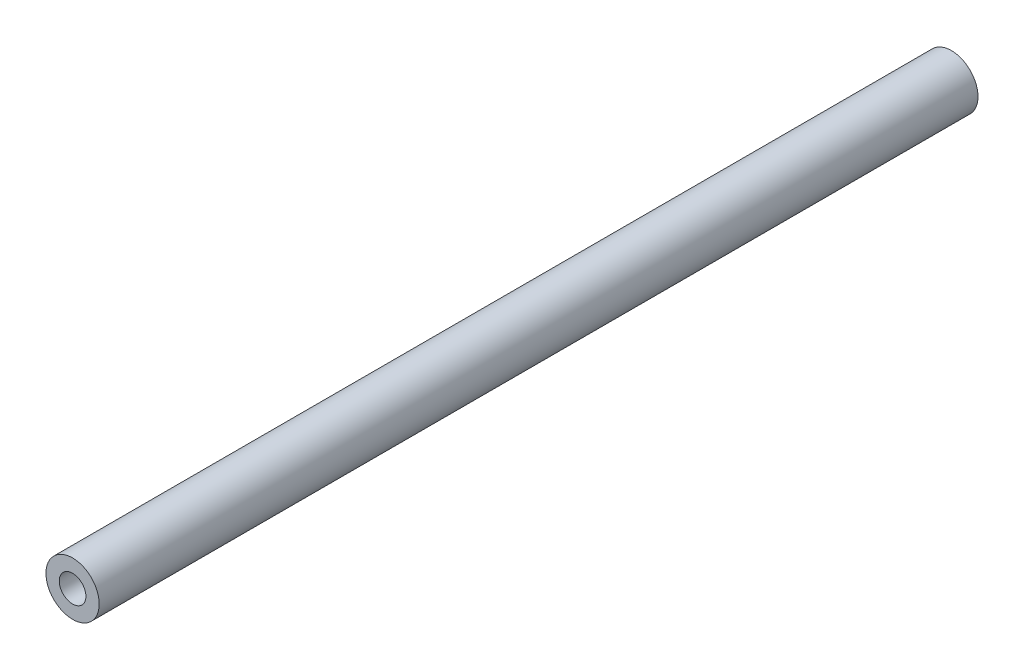
ISO-10303-21;
HEADER;
FILE_DESCRIPTION(('STEP AP214'),'2;1');
FILE_NAME('part.step','',(''),(''),'','','');
FILE_SCHEMA(('AUTOMOTIVE_DESIGN { 1 0 10303 214 1 1 1 1 }'));
ENDSEC;
DATA;
#1=APPLICATION_CONTEXT('core data for automotive mechanical design processes');
#2=APPLICATION_PROTOCOL_DEFINITION('international standard','automotive_design',2000,#1);
#3=PRODUCT_CONTEXT('',#1,'mechanical');
#4=PRODUCT('Part','Part','',(#3));
#5=PRODUCT_RELATED_PRODUCT_CATEGORY('part','',(#4));
#6=PRODUCT_DEFINITION_FORMATION('','',#4);
#7=PRODUCT_DEFINITION_CONTEXT('part definition',#1,'design');
#8=PRODUCT_DEFINITION('design','',#6,#7);
#9=PRODUCT_DEFINITION_SHAPE('','',#8);
#10=(LENGTH_UNIT() NAMED_UNIT(*) SI_UNIT(.MILLI.,.METRE.));
#11=(NAMED_UNIT(*) PLANE_ANGLE_UNIT() SI_UNIT($,.RADIAN.));
#12=(NAMED_UNIT(*) SI_UNIT($,.STERADIAN.) SOLID_ANGLE_UNIT());
#13=UNCERTAINTY_MEASURE_WITH_UNIT(LENGTH_MEASURE(1.E-05),#10,'distance_accuracy_value','');
#14=(GEOMETRIC_REPRESENTATION_CONTEXT(3) GLOBAL_UNCERTAINTY_ASSIGNED_CONTEXT((#13)) GLOBAL_UNIT_ASSIGNED_CONTEXT((#10,
#11,#12)) REPRESENTATION_CONTEXT('',''));
#15=CARTESIAN_POINT('',(0.,0.,0.));
#16=DIRECTION('',(0.,0.,1.));
#17=DIRECTION('',(1.,0.,0.));
#18=AXIS2_PLACEMENT_3D('',#15,#16,#17);
#19=CARTESIAN_POINT('',(0.,0.,104.775));
#20=DIRECTION('',(0.,0.,-1.));
#21=DIRECTION('',(-1.,0.,0.));
#22=AXIS2_PLACEMENT_3D('',#19,#20,#21);
#23=CYLINDRICAL_SURFACE('',#22,6.35);
#24=CARTESIAN_POINT('',(0.,0.,104.775));
#25=DIRECTION('',(0.,0.,1.));
#26=DIRECTION('',(1.,0.,0.));
#27=AXIS2_PLACEMENT_3D('',#24,#25,#26);
#28=CIRCLE('',#27,6.35);
#29=CARTESIAN_POINT('',(6.35,0.,104.775));
#30=VERTEX_POINT('',#29);
#31=EDGE_CURVE('E10',#30,#30,#28,.T.);
#32=ORIENTED_EDGE('',*,*,#31,.F.);
#33=EDGE_LOOP('',(#32));
#34=FACE_BOUND('',#33,.T.);
#35=CARTESIAN_POINT('',(0.,0.,-104.775));
#36=DIRECTION('',(0.,0.,1.));
#37=DIRECTION('',(1.,0.,0.));
#38=AXIS2_PLACEMENT_3D('',#35,#36,#37);
#39=CIRCLE('',#38,6.35);
#40=CARTESIAN_POINT('',(6.35,0.,-104.775));
#41=VERTEX_POINT('',#40);
#42=EDGE_CURVE('E33',#41,#41,#39,.T.);
#43=ORIENTED_EDGE('',*,*,#42,.T.);
#44=EDGE_LOOP('',(#43));
#45=FACE_BOUND('',#44,.T.);
#46=ADVANCED_FACE('F30',(#34,#45),#23,.T.);
#47=CARTESIAN_POINT('',(0.,0.,104.775));
#48=DIRECTION('',(0.,0.,1.));
#49=DIRECTION('',(1.,0.,0.));
#50=AXIS2_PLACEMENT_3D('',#47,#48,#49);
#51=PLANE('',#50);
#52=CARTESIAN_POINT('',(0.,0.,104.775));
#53=DIRECTION('',(0.,0.,1.));
#54=DIRECTION('',(1.,0.,0.));
#55=AXIS2_PLACEMENT_3D('',#52,#53,#54);
#56=CIRCLE('',#55,3.175);
#57=CARTESIAN_POINT('',(3.175,0.,104.775));
#58=VERTEX_POINT('',#57);
#59=EDGE_CURVE('E48',#58,#58,#56,.T.);
#60=ORIENTED_EDGE('',*,*,#59,.F.);
#61=EDGE_LOOP('',(#60));
#62=FACE_BOUND('',#61,.T.);
#63=ORIENTED_EDGE('',*,*,#31,.T.);
#64=EDGE_LOOP('',(#63));
#65=FACE_BOUND('',#64,.T.);
#66=ADVANCED_FACE('F63',(#62,#65),#51,.T.);
#67=CARTESIAN_POINT('',(0.,0.,-104.775));
#68=DIRECTION('',(0.,0.,1.));
#69=DIRECTION('',(1.,0.,0.));
#70=AXIS2_PLACEMENT_3D('',#67,#68,#69);
#71=PLANE('',#70);
#72=CARTESIAN_POINT('',(0.,0.,-104.775));
#73=DIRECTION('',(0.,0.,-1.));
#74=DIRECTION('',(-1.,0.,0.));
#75=AXIS2_PLACEMENT_3D('',#72,#73,#74);
#76=CIRCLE('',#75,3.175);
#77=CARTESIAN_POINT('',(-3.175,0.,-104.775));
#78=VERTEX_POINT('',#77);
#79=EDGE_CURVE('E42',#78,#78,#76,.T.);
#80=ORIENTED_EDGE('',*,*,#79,.F.);
#81=EDGE_LOOP('',(#80));
#82=FACE_BOUND('',#81,.T.);
#83=ORIENTED_EDGE('',*,*,#42,.F.);
#84=EDGE_LOOP('',(#83));
#85=FACE_BOUND('',#84,.T.);
#86=ADVANCED_FACE('F65',(#82,#85),#71,.F.);
#87=CARTESIAN_POINT('',(0.,0.,-85.725));
#88=DIRECTION('',(0.,0.,-1.));
#89=DIRECTION('',(-1.,0.,0.));
#90=AXIS2_PLACEMENT_3D('',#87,#88,#89);
#91=CYLINDRICAL_SURFACE('',#90,3.175);
#92=CARTESIAN_POINT('',(0.,0.,-85.725));
#93=DIRECTION('',(0.,0.,-1.));
#94=DIRECTION('',(-1.,0.,0.));
#95=AXIS2_PLACEMENT_3D('',#92,#93,#94);
#96=CIRCLE('',#95,3.175);
#97=CARTESIAN_POINT('',(-3.175,0.,-85.725));
#98=VERTEX_POINT('',#97);
#99=EDGE_CURVE('E40',#98,#98,#96,.T.);
#100=ORIENTED_EDGE('',*,*,#99,.F.);
#101=EDGE_LOOP('',(#100));
#102=FACE_BOUND('',#101,.T.);
#103=ORIENTED_EDGE('',*,*,#79,.T.);
#104=EDGE_LOOP('',(#103));
#105=FACE_BOUND('',#104,.T.);
#106=ADVANCED_FACE('F71',(#102,#105),#91,.F.);
#107=CARTESIAN_POINT('',(0.,0.,-85.725));
#108=DIRECTION('',(0.,0.,-1.));
#109=DIRECTION('',(-1.,0.,0.));
#110=AXIS2_PLACEMENT_3D('',#107,#108,#109);
#111=PLANE('',#110);
#112=ORIENTED_EDGE('',*,*,#99,.T.);
#113=EDGE_LOOP('',(#112));
#114=FACE_BOUND('',#113,.T.);
#115=ADVANCED_FACE('F59',(#114),#111,.T.);
#116=CARTESIAN_POINT('',(0.,0.,85.725));
#117=DIRECTION('',(0.,0.,1.));
#118=DIRECTION('',(1.,0.,0.));
#119=AXIS2_PLACEMENT_3D('',#116,#117,#118);
#120=CYLINDRICAL_SURFACE('',#119,3.175);
#121=CARTESIAN_POINT('',(0.,0.,85.725));
#122=DIRECTION('',(0.,0.,1.));
#123=DIRECTION('',(1.,0.,0.));
#124=AXIS2_PLACEMENT_3D('',#121,#122,#123);
#125=CIRCLE('',#124,3.175);
#126=CARTESIAN_POINT('',(3.175,0.,85.725));
#127=VERTEX_POINT('',#126);
#128=EDGE_CURVE('E45',#127,#127,#125,.T.);
#129=ORIENTED_EDGE('',*,*,#128,.F.);
#130=EDGE_LOOP('',(#129));
#131=FACE_BOUND('',#130,.T.);
#132=ORIENTED_EDGE('',*,*,#59,.T.);
#133=EDGE_LOOP('',(#132));
#134=FACE_BOUND('',#133,.T.);
#135=ADVANCED_FACE('F56',(#131,#134),#120,.F.);
#136=CARTESIAN_POINT('',(0.,0.,85.725));
#137=DIRECTION('',(0.,0.,1.));
#138=DIRECTION('',(1.,0.,0.));
#139=AXIS2_PLACEMENT_3D('',#136,#137,#138);
#140=PLANE('',#139);
#141=ORIENTED_EDGE('',*,*,#128,.T.);
#142=EDGE_LOOP('',(#141));
#143=FACE_BOUND('',#142,.T.);
#144=ADVANCED_FACE('F54',(#143),#140,.T.);
#145=CLOSED_SHELL('',(#46,#66,#86,#106,#115,#135,#144));
#146=MANIFOLD_SOLID_BREP('B2',#145);
#147=ADVANCED_BREP_SHAPE_REPRESENTATION('',(#18,#146),#14);
#148=SHAPE_DEFINITION_REPRESENTATION(#9,#147);
ENDSEC;
END-ISO-10303-21;
